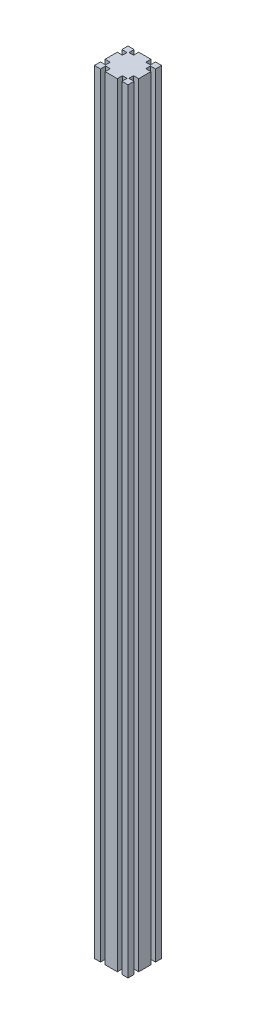
ISO-10303-21;
HEADER;
FILE_DESCRIPTION(('STEP AP214'),'2;1');
FILE_NAME('part.step','',(''),(''),'','','');
FILE_SCHEMA(('AUTOMOTIVE_DESIGN { 1 0 10303 214 1 1 1 1 }'));
ENDSEC;
DATA;
#1=APPLICATION_CONTEXT('core data for automotive mechanical design processes');
#2=APPLICATION_PROTOCOL_DEFINITION('international standard','automotive_design',2000,#1);
#3=PRODUCT_CONTEXT('',#1,'mechanical');
#4=PRODUCT('Part','Part','',(#3));
#5=PRODUCT_RELATED_PRODUCT_CATEGORY('part','',(#4));
#6=PRODUCT_DEFINITION_FORMATION('','',#4);
#7=PRODUCT_DEFINITION_CONTEXT('part definition',#1,'design');
#8=PRODUCT_DEFINITION('design','',#6,#7);
#9=PRODUCT_DEFINITION_SHAPE('','',#8);
#10=(LENGTH_UNIT() NAMED_UNIT(*) SI_UNIT(.MILLI.,.METRE.));
#11=(NAMED_UNIT(*) PLANE_ANGLE_UNIT() SI_UNIT($,.RADIAN.));
#12=(NAMED_UNIT(*) SI_UNIT($,.STERADIAN.) SOLID_ANGLE_UNIT());
#13=UNCERTAINTY_MEASURE_WITH_UNIT(LENGTH_MEASURE(1.E-05),#10,'distance_accuracy_value','');
#14=(GEOMETRIC_REPRESENTATION_CONTEXT(3) GLOBAL_UNCERTAINTY_ASSIGNED_CONTEXT((#13)) GLOBAL_UNIT_ASSIGNED_CONTEXT((#10,
#11,#12)) REPRESENTATION_CONTEXT('',''));
#15=CARTESIAN_POINT('',(0.,0.,0.));
#16=DIRECTION('',(0.,0.,1.));
#17=DIRECTION('',(1.,0.,0.));
#18=AXIS2_PLACEMENT_3D('',#15,#16,#17);
#19=CARTESIAN_POINT('',(19.1,1380.,0.));
#20=DIRECTION('',(-1.,0.,0.));
#21=DIRECTION('',(0.,0.,1.));
#22=AXIS2_PLACEMENT_3D('',#19,#20,#21);
#23=PLANE('',#22);
#24=DIRECTION('',(0.,0.,-1.));
#25=VECTOR('',#24,1.);
#26=CARTESIAN_POINT('',(19.1,0.,0.));
#27=LINE('',#26,#25);
#28=CARTESIAN_POINT('',(19.1,0.,-50.8));
#29=VERTEX_POINT('',#28);
#30=CARTESIAN_POINT('',(19.1,0.,-60.));
#31=VERTEX_POINT('',#30);
#32=EDGE_CURVE('E309',#29,#31,#27,.T.);
#33=ORIENTED_EDGE('',*,*,#32,.F.);
#34=DIRECTION('',(0.,-1.,0.));
#35=VECTOR('',#34,1.);
#36=CARTESIAN_POINT('',(19.1,1380.,-50.8));
#37=LINE('',#36,#35);
#38=CARTESIAN_POINT('',(19.1,1380.,-50.8));
#39=VERTEX_POINT('',#38);
#40=EDGE_CURVE('E11',#39,#29,#37,.T.);
#41=ORIENTED_EDGE('',*,*,#40,.F.);
#42=DIRECTION('',(0.,0.,-1.));
#43=VECTOR('',#42,1.);
#44=CARTESIAN_POINT('',(19.1,1380.,0.));
#45=LINE('',#44,#43);
#46=CARTESIAN_POINT('',(19.1,1380.,-60.));
#47=VERTEX_POINT('',#46);
#48=EDGE_CURVE('E557',#39,#47,#45,.T.);
#49=ORIENTED_EDGE('',*,*,#48,.T.);
#50=DIRECTION('',(0.,-1.,0.));
#51=VECTOR('',#50,1.);
#52=CARTESIAN_POINT('',(19.1,1380.,-60.));
#53=LINE('',#52,#51);
#54=EDGE_CURVE('E58',#47,#31,#53,.T.);
#55=ORIENTED_EDGE('',*,*,#54,.T.);
#56=EDGE_LOOP('',(#33,#41,#49,#55));
#57=FACE_BOUND('',#56,.T.);
#58=ADVANCED_FACE('F41',(#57),#23,.T.);
#59=CARTESIAN_POINT('',(0.,1380.,-50.8));
#60=DIRECTION('',(0.,0.,-1.));
#61=DIRECTION('',(-1.,0.,0.));
#62=AXIS2_PLACEMENT_3D('',#59,#60,#61);
#63=PLANE('',#62);
#64=DIRECTION('',(1.,0.,0.));
#65=VECTOR('',#64,1.);
#66=CARTESIAN_POINT('',(0.,0.,-50.8));
#67=LINE('',#66,#65);
#68=CARTESIAN_POINT('',(10.9,0.,-50.8));
#69=VERTEX_POINT('',#68);
#70=EDGE_CURVE('E312',#69,#29,#67,.T.);
#71=ORIENTED_EDGE('',*,*,#70,.F.);
#72=DIRECTION('',(0.,-1.,0.));
#73=VECTOR('',#72,1.);
#74=CARTESIAN_POINT('',(10.9,1380.,-50.8));
#75=LINE('',#74,#73);
#76=CARTESIAN_POINT('',(10.9,1380.,-50.8));
#77=VERTEX_POINT('',#76);
#78=EDGE_CURVE('E50',#77,#69,#75,.T.);
#79=ORIENTED_EDGE('',*,*,#78,.F.);
#80=DIRECTION('',(1.,0.,0.));
#81=VECTOR('',#80,1.);
#82=CARTESIAN_POINT('',(0.,1380.,-50.8));
#83=LINE('',#82,#81);
#84=EDGE_CURVE('E551',#77,#39,#83,.T.);
#85=ORIENTED_EDGE('',*,*,#84,.T.);
#86=ORIENTED_EDGE('',*,*,#40,.T.);
#87=EDGE_LOOP('',(#71,#79,#85,#86));
#88=FACE_BOUND('',#87,.T.);
#89=ADVANCED_FACE('F540',(#88),#63,.T.);
#90=CARTESIAN_POINT('',(10.9,1380.,0.));
#91=DIRECTION('',(1.,0.,0.));
#92=DIRECTION('',(0.,0.,-1.));
#93=AXIS2_PLACEMENT_3D('',#90,#91,#92);
#94=PLANE('',#93);
#95=DIRECTION('',(0.,0.,1.));
#96=VECTOR('',#95,1.);
#97=CARTESIAN_POINT('',(10.9,0.,0.));
#98=LINE('',#97,#96);
#99=CARTESIAN_POINT('',(10.9,0.,-60.));
#100=VERTEX_POINT('',#99);
#101=EDGE_CURVE('E316',#100,#69,#98,.T.);
#102=ORIENTED_EDGE('',*,*,#101,.F.);
#103=DIRECTION('',(0.,-1.,0.));
#104=VECTOR('',#103,1.);
#105=CARTESIAN_POINT('',(10.9,1380.,-60.));
#106=LINE('',#105,#104);
#107=CARTESIAN_POINT('',(10.9,1380.,-60.));
#108=VERTEX_POINT('',#107);
#109=EDGE_CURVE('E527',#108,#100,#106,.T.);
#110=ORIENTED_EDGE('',*,*,#109,.F.);
#111=DIRECTION('',(0.,0.,1.));
#112=VECTOR('',#111,1.);
#113=CARTESIAN_POINT('',(10.9,1380.,0.));
#114=LINE('',#113,#112);
#115=EDGE_CURVE('E536',#108,#77,#114,.T.);
#116=ORIENTED_EDGE('',*,*,#115,.T.);
#117=ORIENTED_EDGE('',*,*,#78,.T.);
#118=EDGE_LOOP('',(#102,#110,#116,#117));
#119=FACE_BOUND('',#118,.T.);
#120=ADVANCED_FACE('F534',(#119),#94,.T.);
#121=CARTESIAN_POINT('',(0.,1380.,-60.));
#122=DIRECTION('',(0.,0.,-1.));
#123=DIRECTION('',(-1.,0.,0.));
#124=AXIS2_PLACEMENT_3D('',#121,#122,#123);
#125=PLANE('',#124);
#126=DIRECTION('',(1.,0.,0.));
#127=VECTOR('',#126,1.);
#128=CARTESIAN_POINT('',(0.,0.,-60.));
#129=LINE('',#128,#127);
#130=CARTESIAN_POINT('',(0.,0.,-60.));
#131=VERTEX_POINT('',#130);
#132=EDGE_CURVE('E320',#131,#100,#129,.T.);
#133=ORIENTED_EDGE('',*,*,#132,.F.);
#134=DIRECTION('',(0.,-1.,0.));
#135=VECTOR('',#134,1.);
#136=CARTESIAN_POINT('',(0.,1380.,-60.));
#137=LINE('',#136,#135);
#138=CARTESIAN_POINT('',(0.,1380.,-60.));
#139=VERTEX_POINT('',#138);
#140=EDGE_CURVE('E524',#139,#131,#137,.T.);
#141=ORIENTED_EDGE('',*,*,#140,.F.);
#142=DIRECTION('',(1.,0.,0.));
#143=VECTOR('',#142,1.);
#144=CARTESIAN_POINT('',(0.,1380.,-60.));
#145=LINE('',#144,#143);
#146=EDGE_CURVE('E306',#139,#108,#145,.T.);
#147=ORIENTED_EDGE('',*,*,#146,.T.);
#148=ORIENTED_EDGE('',*,*,#109,.T.);
#149=EDGE_LOOP('',(#133,#141,#147,#148));
#150=FACE_BOUND('',#149,.T.);
#151=ADVANCED_FACE('F547',(#150),#125,.T.);
#152=CARTESIAN_POINT('',(0.,1380.,0.));
#153=DIRECTION('',(1.,0.,0.));
#154=DIRECTION('',(0.,0.,-1.));
#155=AXIS2_PLACEMENT_3D('',#152,#153,#154);
#156=PLANE('',#155);
#157=DIRECTION('',(0.,0.,1.));
#158=VECTOR('',#157,1.);
#159=CARTESIAN_POINT('',(0.,0.,0.));
#160=LINE('',#159,#158);
#161=CARTESIAN_POINT('',(0.,0.,-49.1));
#162=VERTEX_POINT('',#161);
#163=EDGE_CURVE('E324',#131,#162,#160,.T.);
#164=ORIENTED_EDGE('',*,*,#163,.T.);
#165=DIRECTION('',(0.,-1.,0.));
#166=VECTOR('',#165,1.);
#167=CARTESIAN_POINT('',(0.,1380.,-49.1));
#168=LINE('',#167,#166);
#169=CARTESIAN_POINT('',(0.,1380.,-49.1));
#170=VERTEX_POINT('',#169);
#171=EDGE_CURVE('E520',#170,#162,#168,.T.);
#172=ORIENTED_EDGE('',*,*,#171,.F.);
#173=DIRECTION('',(0.,0.,1.));
#174=VECTOR('',#173,1.);
#175=CARTESIAN_POINT('',(0.,1380.,0.));
#176=LINE('',#175,#174);
#177=EDGE_CURVE('E556',#139,#170,#176,.T.);
#178=ORIENTED_EDGE('',*,*,#177,.F.);
#179=ORIENTED_EDGE('',*,*,#140,.T.);
#180=EDGE_LOOP('',(#164,#172,#178,#179));
#181=FACE_BOUND('',#180,.T.);
#182=ADVANCED_FACE('F741',(#181),#156,.F.);
#183=CARTESIAN_POINT('',(0.,1380.,-49.1));
#184=DIRECTION('',(0.,0.,-1.));
#185=DIRECTION('',(-1.,0.,0.));
#186=AXIS2_PLACEMENT_3D('',#183,#184,#185);
#187=PLANE('',#186);
#188=DIRECTION('',(1.,0.,0.));
#189=VECTOR('',#188,1.);
#190=CARTESIAN_POINT('',(0.,0.,-49.1));
#191=LINE('',#190,#189);
#192=CARTESIAN_POINT('',(9.2,0.,-49.1));
#193=VERTEX_POINT('',#192);
#194=EDGE_CURVE('E328',#162,#193,#191,.T.);
#195=ORIENTED_EDGE('',*,*,#194,.T.);
#196=DIRECTION('',(0.,-1.,0.));
#197=VECTOR('',#196,1.);
#198=CARTESIAN_POINT('',(9.2,1380.,-49.1));
#199=LINE('',#198,#197);
#200=CARTESIAN_POINT('',(9.2,1380.,-49.1));
#201=VERTEX_POINT('',#200);
#202=EDGE_CURVE('E516',#201,#193,#199,.T.);
#203=ORIENTED_EDGE('',*,*,#202,.F.);
#204=DIRECTION('',(1.,0.,0.));
#205=VECTOR('',#204,1.);
#206=CARTESIAN_POINT('',(0.,1380.,-49.1));
#207=LINE('',#206,#205);
#208=EDGE_CURVE('E563',#170,#201,#207,.T.);
#209=ORIENTED_EDGE('',*,*,#208,.F.);
#210=ORIENTED_EDGE('',*,*,#171,.T.);
#211=EDGE_LOOP('',(#195,#203,#209,#210));
#212=FACE_BOUND('',#211,.T.);
#213=ADVANCED_FACE('F753',(#212),#187,.F.);
#214=CARTESIAN_POINT('',(9.20000000000001,1380.,0.));
#215=DIRECTION('',(1.,0.,0.));
#216=DIRECTION('',(0.,0.,-1.));
#217=AXIS2_PLACEMENT_3D('',#214,#215,#216);
#218=PLANE('',#217);
#219=DIRECTION('',(0.,0.,1.));
#220=VECTOR('',#219,1.);
#221=CARTESIAN_POINT('',(9.20000000000001,0.,0.));
#222=LINE('',#221,#220);
#223=CARTESIAN_POINT('',(9.2,0.,-40.9));
#224=VERTEX_POINT('',#223);
#225=EDGE_CURVE('E331',#193,#224,#222,.T.);
#226=ORIENTED_EDGE('',*,*,#225,.T.);
#227=DIRECTION('',(0.,-1.,0.));
#228=VECTOR('',#227,1.);
#229=CARTESIAN_POINT('',(9.2,1380.,-40.9));
#230=LINE('',#229,#228);
#231=CARTESIAN_POINT('',(9.2,1380.,-40.9));
#232=VERTEX_POINT('',#231);
#233=EDGE_CURVE('E512',#232,#224,#230,.T.);
#234=ORIENTED_EDGE('',*,*,#233,.F.);
#235=DIRECTION('',(0.,0.,1.));
#236=VECTOR('',#235,1.);
#237=CARTESIAN_POINT('',(9.20000000000001,1380.,0.));
#238=LINE('',#237,#236);
#239=EDGE_CURVE('E566',#201,#232,#238,.T.);
#240=ORIENTED_EDGE('',*,*,#239,.F.);
#241=ORIENTED_EDGE('',*,*,#202,.T.);
#242=EDGE_LOOP('',(#226,#234,#240,#241));
#243=FACE_BOUND('',#242,.T.);
#244=ADVANCED_FACE('F757',(#243),#218,.F.);
#245=CARTESIAN_POINT('',(0.,1380.,-40.9));
#246=DIRECTION('',(0.,0.,1.));
#247=DIRECTION('',(1.,0.,0.));
#248=AXIS2_PLACEMENT_3D('',#245,#246,#247);
#249=PLANE('',#248);
#250=DIRECTION('',(-1.,0.,0.));
#251=VECTOR('',#250,1.);
#252=CARTESIAN_POINT('',(0.,0.,-40.9));
#253=LINE('',#252,#251);
#254=CARTESIAN_POINT('',(0.,0.,-40.9));
#255=VERTEX_POINT('',#254);
#256=EDGE_CURVE('E334',#224,#255,#253,.T.);
#257=ORIENTED_EDGE('',*,*,#256,.T.);
#258=DIRECTION('',(0.,-1.,0.));
#259=VECTOR('',#258,1.);
#260=CARTESIAN_POINT('',(0.,1380.,-40.9));
#261=LINE('',#260,#259);
#262=CARTESIAN_POINT('',(0.,1380.,-40.9));
#263=VERTEX_POINT('',#262);
#264=EDGE_CURVE('E509',#263,#255,#261,.T.);
#265=ORIENTED_EDGE('',*,*,#264,.F.);
#266=DIRECTION('',(-1.,0.,0.));
#267=VECTOR('',#266,1.);
#268=CARTESIAN_POINT('',(0.,1380.,-40.9));
#269=LINE('',#268,#267);
#270=EDGE_CURVE('E569',#232,#263,#269,.T.);
#271=ORIENTED_EDGE('',*,*,#270,.F.);
#272=ORIENTED_EDGE('',*,*,#233,.T.);
#273=EDGE_LOOP('',(#257,#265,#271,#272));
#274=FACE_BOUND('',#273,.T.);
#275=ADVANCED_FACE('F761',(#274),#249,.F.);
#276=CARTESIAN_POINT('',(0.,1380.,0.));
#277=DIRECTION('',(-1.,0.,0.));
#278=DIRECTION('',(0.,0.,1.));
#279=AXIS2_PLACEMENT_3D('',#276,#277,#278);
#280=PLANE('',#279);
#281=DIRECTION('',(0.,0.,-1.));
#282=VECTOR('',#281,1.);
#283=CARTESIAN_POINT('',(0.,0.,0.));
#284=LINE('',#283,#282);
#285=CARTESIAN_POINT('',(0.,0.,-19.1));
#286=VERTEX_POINT('',#285);
#287=EDGE_CURVE('E338',#286,#255,#284,.T.);
#288=ORIENTED_EDGE('',*,*,#287,.F.);
#289=DIRECTION('',(0.,-1.,0.));
#290=VECTOR('',#289,1.);
#291=CARTESIAN_POINT('',(0.,1380.,-19.1));
#292=LINE('',#291,#290);
#293=CARTESIAN_POINT('',(0.,1380.,-19.1));
#294=VERTEX_POINT('',#293);
#295=EDGE_CURVE('E506',#294,#286,#292,.T.);
#296=ORIENTED_EDGE('',*,*,#295,.F.);
#297=DIRECTION('',(0.,0.,-1.));
#298=VECTOR('',#297,1.);
#299=CARTESIAN_POINT('',(0.,1380.,0.));
#300=LINE('',#299,#298);
#301=EDGE_CURVE('E572',#294,#263,#300,.T.);
#302=ORIENTED_EDGE('',*,*,#301,.T.);
#303=ORIENTED_EDGE('',*,*,#264,.T.);
#304=EDGE_LOOP('',(#288,#296,#302,#303));
#305=FACE_BOUND('',#304,.T.);
#306=ADVANCED_FACE('F765',(#305),#280,.T.);
#307=CARTESIAN_POINT('',(0.,1380.,-19.1));
#308=DIRECTION('',(0.,0.,1.));
#309=DIRECTION('',(1.,0.,0.));
#310=AXIS2_PLACEMENT_3D('',#307,#308,#309);
#311=PLANE('',#310);
#312=DIRECTION('',(-1.,0.,0.));
#313=VECTOR('',#312,1.);
#314=CARTESIAN_POINT('',(0.,0.,-19.1));
#315=LINE('',#314,#313);
#316=CARTESIAN_POINT('',(9.20000000000002,0.,-19.1));
#317=VERTEX_POINT('',#316);
#318=EDGE_CURVE('E342',#317,#286,#315,.T.);
#319=ORIENTED_EDGE('',*,*,#318,.F.);
#320=DIRECTION('',(0.,-1.,0.));
#321=VECTOR('',#320,1.);
#322=CARTESIAN_POINT('',(9.20000000000002,1380.,-19.1));
#323=LINE('',#322,#321);
#324=CARTESIAN_POINT('',(9.20000000000002,1380.,-19.1));
#325=VERTEX_POINT('',#324);
#326=EDGE_CURVE('E503',#325,#317,#323,.T.);
#327=ORIENTED_EDGE('',*,*,#326,.F.);
#328=DIRECTION('',(-1.,0.,0.));
#329=VECTOR('',#328,1.);
#330=CARTESIAN_POINT('',(0.,1380.,-19.1));
#331=LINE('',#330,#329);
#332=EDGE_CURVE('E576',#325,#294,#331,.T.);
#333=ORIENTED_EDGE('',*,*,#332,.T.);
#334=ORIENTED_EDGE('',*,*,#295,.T.);
#335=EDGE_LOOP('',(#319,#327,#333,#334));
#336=FACE_BOUND('',#335,.T.);
#337=ADVANCED_FACE('F769',(#336),#311,.T.);
#338=CARTESIAN_POINT('',(9.2,1380.,0.));
#339=DIRECTION('',(-1.,0.,0.));
#340=DIRECTION('',(0.,0.,1.));
#341=AXIS2_PLACEMENT_3D('',#338,#339,#340);
#342=PLANE('',#341);
#343=DIRECTION('',(0.,0.,-1.));
#344=VECTOR('',#343,1.);
#345=CARTESIAN_POINT('',(9.2,0.,0.));
#346=LINE('',#345,#344);
#347=CARTESIAN_POINT('',(9.20000000000001,0.,-10.9));
#348=VERTEX_POINT('',#347);
#349=EDGE_CURVE('E346',#348,#317,#346,.T.);
#350=ORIENTED_EDGE('',*,*,#349,.F.);
#351=DIRECTION('',(0.,-1.,0.));
#352=VECTOR('',#351,1.);
#353=CARTESIAN_POINT('',(9.20000000000001,1380.,-10.9));
#354=LINE('',#353,#352);
#355=CARTESIAN_POINT('',(9.20000000000001,1380.,-10.9));
#356=VERTEX_POINT('',#355);
#357=EDGE_CURVE('E500',#356,#348,#354,.T.);
#358=ORIENTED_EDGE('',*,*,#357,.F.);
#359=DIRECTION('',(0.,0.,-1.));
#360=VECTOR('',#359,1.);
#361=CARTESIAN_POINT('',(9.2,1380.,0.));
#362=LINE('',#361,#360);
#363=EDGE_CURVE('E580',#356,#325,#362,.T.);
#364=ORIENTED_EDGE('',*,*,#363,.T.);
#365=ORIENTED_EDGE('',*,*,#326,.T.);
#366=EDGE_LOOP('',(#350,#358,#364,#365));
#367=FACE_BOUND('',#366,.T.);
#368=ADVANCED_FACE('F773',(#367),#342,.T.);
#369=CARTESIAN_POINT('',(0.,1380.,-10.9));
#370=DIRECTION('',(0.,0.,-1.));
#371=DIRECTION('',(-1.,0.,0.));
#372=AXIS2_PLACEMENT_3D('',#369,#370,#371);
#373=PLANE('',#372);
#374=DIRECTION('',(1.,0.,0.));
#375=VECTOR('',#374,1.);
#376=CARTESIAN_POINT('',(0.,0.,-10.9));
#377=LINE('',#376,#375);
#378=CARTESIAN_POINT('',(0.,0.,-10.9));
#379=VERTEX_POINT('',#378);
#380=EDGE_CURVE('E350',#379,#348,#377,.T.);
#381=ORIENTED_EDGE('',*,*,#380,.F.);
#382=DIRECTION('',(0.,-1.,0.));
#383=VECTOR('',#382,1.);
#384=CARTESIAN_POINT('',(0.,1380.,-10.9));
#385=LINE('',#384,#383);
#386=CARTESIAN_POINT('',(0.,1380.,-10.9));
#387=VERTEX_POINT('',#386);
#388=EDGE_CURVE('E497',#387,#379,#385,.T.);
#389=ORIENTED_EDGE('',*,*,#388,.F.);
#390=DIRECTION('',(1.,0.,0.));
#391=VECTOR('',#390,1.);
#392=CARTESIAN_POINT('',(0.,1380.,-10.9));
#393=LINE('',#392,#391);
#394=EDGE_CURVE('E584',#387,#356,#393,.T.);
#395=ORIENTED_EDGE('',*,*,#394,.T.);
#396=ORIENTED_EDGE('',*,*,#357,.T.);
#397=EDGE_LOOP('',(#381,#389,#395,#396));
#398=FACE_BOUND('',#397,.T.);
#399=ADVANCED_FACE('F777',(#398),#373,.T.);
#400=CARTESIAN_POINT('',(0.,1380.,0.));
#401=DIRECTION('',(-1.,0.,0.));
#402=DIRECTION('',(0.,0.,1.));
#403=AXIS2_PLACEMENT_3D('',#400,#401,#402);
#404=PLANE('',#403);
#405=DIRECTION('',(0.,0.,-1.));
#406=VECTOR('',#405,1.);
#407=CARTESIAN_POINT('',(0.,0.,0.));
#408=LINE('',#407,#406);
#409=CARTESIAN_POINT('',(0.,0.,0.));
#410=VERTEX_POINT('',#409);
#411=EDGE_CURVE('E354',#410,#379,#408,.T.);
#412=ORIENTED_EDGE('',*,*,#411,.F.);
#413=DIRECTION('',(0.,-1.,0.));
#414=VECTOR('',#413,1.);
#415=CARTESIAN_POINT('',(0.,1380.,0.));
#416=LINE('',#415,#414);
#417=CARTESIAN_POINT('',(0.,1380.,0.));
#418=VERTEX_POINT('',#417);
#419=EDGE_CURVE('E494',#418,#410,#416,.T.);
#420=ORIENTED_EDGE('',*,*,#419,.F.);
#421=DIRECTION('',(0.,0.,-1.));
#422=VECTOR('',#421,1.);
#423=CARTESIAN_POINT('',(0.,1380.,0.));
#424=LINE('',#423,#422);
#425=EDGE_CURVE('E588',#418,#387,#424,.T.);
#426=ORIENTED_EDGE('',*,*,#425,.T.);
#427=ORIENTED_EDGE('',*,*,#388,.T.);
#428=EDGE_LOOP('',(#412,#420,#426,#427));
#429=FACE_BOUND('',#428,.T.);
#430=ADVANCED_FACE('F781',(#429),#404,.T.);
#431=CARTESIAN_POINT('',(0.,1380.,0.));
#432=DIRECTION('',(0.,0.,-1.));
#433=DIRECTION('',(-1.,0.,0.));
#434=AXIS2_PLACEMENT_3D('',#431,#432,#433);
#435=PLANE('',#434);
#436=DIRECTION('',(1.,0.,0.));
#437=VECTOR('',#436,1.);
#438=CARTESIAN_POINT('',(0.,0.,0.));
#439=LINE('',#438,#437);
#440=CARTESIAN_POINT('',(10.9,0.,0.));
#441=VERTEX_POINT('',#440);
#442=EDGE_CURVE('E358',#410,#441,#439,.T.);
#443=ORIENTED_EDGE('',*,*,#442,.T.);
#444=DIRECTION('',(0.,-1.,0.));
#445=VECTOR('',#444,1.);
#446=CARTESIAN_POINT('',(10.9,1380.,0.));
#447=LINE('',#446,#445);
#448=CARTESIAN_POINT('',(10.9,1380.,0.));
#449=VERTEX_POINT('',#448);
#450=EDGE_CURVE('E490',#449,#441,#447,.T.);
#451=ORIENTED_EDGE('',*,*,#450,.F.);
#452=DIRECTION('',(1.,0.,0.));
#453=VECTOR('',#452,1.);
#454=CARTESIAN_POINT('',(0.,1380.,0.));
#455=LINE('',#454,#453);
#456=EDGE_CURVE('E592',#418,#449,#455,.T.);
#457=ORIENTED_EDGE('',*,*,#456,.F.);
#458=ORIENTED_EDGE('',*,*,#419,.T.);
#459=EDGE_LOOP('',(#443,#451,#457,#458));
#460=FACE_BOUND('',#459,.T.);
#461=ADVANCED_FACE('F785',(#460),#435,.F.);
#462=CARTESIAN_POINT('',(10.9,1380.,0.));
#463=DIRECTION('',(-1.,0.,0.));
#464=DIRECTION('',(0.,0.,1.));
#465=AXIS2_PLACEMENT_3D('',#462,#463,#464);
#466=PLANE('',#465);
#467=DIRECTION('',(0.,0.,-1.));
#468=VECTOR('',#467,1.);
#469=CARTESIAN_POINT('',(10.9,0.,0.));
#470=LINE('',#469,#468);
#471=CARTESIAN_POINT('',(10.9,0.,-9.20000000000001));
#472=VERTEX_POINT('',#471);
#473=EDGE_CURVE('E361',#441,#472,#470,.T.);
#474=ORIENTED_EDGE('',*,*,#473,.T.);
#475=DIRECTION('',(0.,-1.,0.));
#476=VECTOR('',#475,1.);
#477=CARTESIAN_POINT('',(10.9,1380.,-9.20000000000001));
#478=LINE('',#477,#476);
#479=CARTESIAN_POINT('',(10.9,1380.,-9.20000000000001));
#480=VERTEX_POINT('',#479);
#481=EDGE_CURVE('E486',#480,#472,#478,.T.);
#482=ORIENTED_EDGE('',*,*,#481,.F.);
#483=DIRECTION('',(0.,0.,-1.));
#484=VECTOR('',#483,1.);
#485=CARTESIAN_POINT('',(10.9,1380.,0.));
#486=LINE('',#485,#484);
#487=EDGE_CURVE('E595',#449,#480,#486,.T.);
#488=ORIENTED_EDGE('',*,*,#487,.F.);
#489=ORIENTED_EDGE('',*,*,#450,.T.);
#490=EDGE_LOOP('',(#474,#482,#488,#489));
#491=FACE_BOUND('',#490,.T.);
#492=ADVANCED_FACE('F787',(#491),#466,.F.);
#493=CARTESIAN_POINT('',(0.,1380.,-9.19999999999999));
#494=DIRECTION('',(0.,0.,-1.));
#495=DIRECTION('',(-1.,0.,0.));
#496=AXIS2_PLACEMENT_3D('',#493,#494,#495);
#497=PLANE('',#496);
#498=DIRECTION('',(1.,0.,0.));
#499=VECTOR('',#498,1.);
#500=CARTESIAN_POINT('',(0.,0.,-9.19999999999999));
#501=LINE('',#500,#499);
#502=CARTESIAN_POINT('',(19.1,0.,-9.20000000000003));
#503=VERTEX_POINT('',#502);
#504=EDGE_CURVE('E366',#472,#503,#501,.T.);
#505=ORIENTED_EDGE('',*,*,#504,.T.);
#506=DIRECTION('',(0.,-1.,0.));
#507=VECTOR('',#506,1.);
#508=CARTESIAN_POINT('',(19.1,1380.,-9.20000000000003));
#509=LINE('',#508,#507);
#510=CARTESIAN_POINT('',(19.1,1380.,-9.20000000000003));
#511=VERTEX_POINT('',#510);
#512=EDGE_CURVE('E482',#511,#503,#509,.T.);
#513=ORIENTED_EDGE('',*,*,#512,.F.);
#514=DIRECTION('',(1.,0.,0.));
#515=VECTOR('',#514,1.);
#516=CARTESIAN_POINT('',(0.,1380.,-9.19999999999999));
#517=LINE('',#516,#515);
#518=EDGE_CURVE('E600',#480,#511,#517,.T.);
#519=ORIENTED_EDGE('',*,*,#518,.F.);
#520=ORIENTED_EDGE('',*,*,#481,.T.);
#521=EDGE_LOOP('',(#505,#513,#519,#520));
#522=FACE_BOUND('',#521,.T.);
#523=ADVANCED_FACE('F790',(#522),#497,.F.);
#524=CARTESIAN_POINT('',(19.1,1380.,0.));
#525=DIRECTION('',(1.,0.,0.));
#526=DIRECTION('',(0.,0.,-1.));
#527=AXIS2_PLACEMENT_3D('',#524,#525,#526);
#528=PLANE('',#527);
#529=DIRECTION('',(0.,0.,1.));
#530=VECTOR('',#529,1.);
#531=CARTESIAN_POINT('',(19.1,0.,0.));
#532=LINE('',#531,#530);
#533=CARTESIAN_POINT('',(19.1,0.,0.));
#534=VERTEX_POINT('',#533);
#535=EDGE_CURVE('E369',#503,#534,#532,.T.);
#536=ORIENTED_EDGE('',*,*,#535,.T.);
#537=DIRECTION('',(0.,-1.,0.));
#538=VECTOR('',#537,1.);
#539=CARTESIAN_POINT('',(19.1,1380.,0.));
#540=LINE('',#539,#538);
#541=CARTESIAN_POINT('',(19.1,1380.,0.));
#542=VERTEX_POINT('',#541);
#543=EDGE_CURVE('E478',#542,#534,#540,.T.);
#544=ORIENTED_EDGE('',*,*,#543,.F.);
#545=DIRECTION('',(0.,0.,1.));
#546=VECTOR('',#545,1.);
#547=CARTESIAN_POINT('',(19.1,1380.,0.));
#548=LINE('',#547,#546);
#549=EDGE_CURVE('E603',#511,#542,#548,.T.);
#550=ORIENTED_EDGE('',*,*,#549,.F.);
#551=ORIENTED_EDGE('',*,*,#512,.T.);
#552=EDGE_LOOP('',(#536,#544,#550,#551));
#553=FACE_BOUND('',#552,.T.);
#554=ADVANCED_FACE('F794',(#553),#528,.F.);
#555=CARTESIAN_POINT('',(40.9,0.,0.));
#556=VERTEX_POINT('',#555);
#557=EDGE_CURVE('E363',#534,#556,#439,.T.);
#558=ORIENTED_EDGE('',*,*,#557,.T.);
#559=DIRECTION('',(0.,-1.,0.));
#560=VECTOR('',#559,1.);
#561=CARTESIAN_POINT('',(40.9,1380.,0.));
#562=LINE('',#561,#560);
#563=CARTESIAN_POINT('',(40.9,1380.,0.));
#564=VERTEX_POINT('',#563);
#565=EDGE_CURVE('E475',#564,#556,#562,.T.);
#566=ORIENTED_EDGE('',*,*,#565,.F.);
#567=EDGE_CURVE('E597',#542,#564,#455,.T.);
#568=ORIENTED_EDGE('',*,*,#567,.F.);
#569=ORIENTED_EDGE('',*,*,#543,.T.);
#570=EDGE_LOOP('',(#558,#566,#568,#569));
#571=FACE_BOUND('',#570,.T.);
#572=ADVANCED_FACE('F660',(#571),#435,.F.);
#573=CARTESIAN_POINT('',(40.9,1380.,0.));
#574=DIRECTION('',(1.,0.,0.));
#575=DIRECTION('',(0.,0.,-1.));
#576=AXIS2_PLACEMENT_3D('',#573,#574,#575);
#577=PLANE('',#576);
#578=DIRECTION('',(0.,0.,1.));
#579=VECTOR('',#578,1.);
#580=CARTESIAN_POINT('',(40.9,0.,0.));
#581=LINE('',#580,#579);
#582=CARTESIAN_POINT('',(40.9,0.,-9.19999999999999));
#583=VERTEX_POINT('',#582);
#584=EDGE_CURVE('E372',#583,#556,#581,.T.);
#585=ORIENTED_EDGE('',*,*,#584,.F.);
#586=DIRECTION('',(0.,-1.,0.));
#587=VECTOR('',#586,1.);
#588=CARTESIAN_POINT('',(40.9,1380.,-9.19999999999999));
#589=LINE('',#588,#587);
#590=CARTESIAN_POINT('',(40.9,1380.,-9.19999999999999));
#591=VERTEX_POINT('',#590);
#592=EDGE_CURVE('E472',#591,#583,#589,.T.);
#593=ORIENTED_EDGE('',*,*,#592,.F.);
#594=DIRECTION('',(0.,0.,1.));
#595=VECTOR('',#594,1.);
#596=CARTESIAN_POINT('',(40.9,1380.,0.));
#597=LINE('',#596,#595);
#598=EDGE_CURVE('E606',#591,#564,#597,.T.);
#599=ORIENTED_EDGE('',*,*,#598,.T.);
#600=ORIENTED_EDGE('',*,*,#565,.T.);
#601=EDGE_LOOP('',(#585,#593,#599,#600));
#602=FACE_BOUND('',#601,.T.);
#603=ADVANCED_FACE('F664',(#602),#577,.T.);
#604=CARTESIAN_POINT('',(0.,1380.,-9.19999999999999));
#605=DIRECTION('',(0.,0.,1.));
#606=DIRECTION('',(1.,0.,0.));
#607=AXIS2_PLACEMENT_3D('',#604,#605,#606);
#608=PLANE('',#607);
#609=DIRECTION('',(-1.,0.,0.));
#610=VECTOR('',#609,1.);
#611=CARTESIAN_POINT('',(0.,0.,-9.19999999999999));
#612=LINE('',#611,#610);
#613=CARTESIAN_POINT('',(49.1,0.,-9.19999999999999));
#614=VERTEX_POINT('',#613);
#615=EDGE_CURVE('E376',#614,#583,#612,.T.);
#616=ORIENTED_EDGE('',*,*,#615,.F.);
#617=DIRECTION('',(0.,-1.,0.));
#618=VECTOR('',#617,1.);
#619=CARTESIAN_POINT('',(49.1,1380.,-9.19999999999999));
#620=LINE('',#619,#618);
#621=CARTESIAN_POINT('',(49.1,1380.,-9.19999999999999));
#622=VERTEX_POINT('',#621);
#623=EDGE_CURVE('E469',#622,#614,#620,.T.);
#624=ORIENTED_EDGE('',*,*,#623,.F.);
#625=DIRECTION('',(-1.,0.,0.));
#626=VECTOR('',#625,1.);
#627=CARTESIAN_POINT('',(0.,1380.,-9.19999999999999));
#628=LINE('',#627,#626);
#629=EDGE_CURVE('E610',#622,#591,#628,.T.);
#630=ORIENTED_EDGE('',*,*,#629,.T.);
#631=ORIENTED_EDGE('',*,*,#592,.T.);
#632=EDGE_LOOP('',(#616,#624,#630,#631));
#633=FACE_BOUND('',#632,.T.);
#634=ADVANCED_FACE('F667',(#633),#608,.T.);
#635=CARTESIAN_POINT('',(49.1,1380.,0.));
#636=DIRECTION('',(-1.,0.,0.));
#637=DIRECTION('',(0.,0.,1.));
#638=AXIS2_PLACEMENT_3D('',#635,#636,#637);
#639=PLANE('',#638);
#640=DIRECTION('',(0.,0.,-1.));
#641=VECTOR('',#640,1.);
#642=CARTESIAN_POINT('',(49.1,0.,0.));
#643=LINE('',#642,#641);
#644=CARTESIAN_POINT('',(49.1,0.,0.));
#645=VERTEX_POINT('',#644);
#646=EDGE_CURVE('E380',#645,#614,#643,.T.);
#647=ORIENTED_EDGE('',*,*,#646,.F.);
#648=DIRECTION('',(0.,-1.,0.));
#649=VECTOR('',#648,1.);
#650=CARTESIAN_POINT('',(49.1,1380.,0.));
#651=LINE('',#650,#649);
#652=CARTESIAN_POINT('',(49.1,1380.,0.));
#653=VERTEX_POINT('',#652);
#654=EDGE_CURVE('E466',#653,#645,#651,.T.);
#655=ORIENTED_EDGE('',*,*,#654,.F.);
#656=DIRECTION('',(0.,0.,-1.));
#657=VECTOR('',#656,1.);
#658=CARTESIAN_POINT('',(49.1,1380.,0.));
#659=LINE('',#658,#657);
#660=EDGE_CURVE('E614',#653,#622,#659,.T.);
#661=ORIENTED_EDGE('',*,*,#660,.T.);
#662=ORIENTED_EDGE('',*,*,#623,.T.);
#663=EDGE_LOOP('',(#647,#655,#661,#662));
#664=FACE_BOUND('',#663,.T.);
#665=ADVANCED_FACE('F671',(#664),#639,.T.);
#666=CARTESIAN_POINT('',(60.,0.,0.));
#667=VERTEX_POINT('',#666);
#668=EDGE_CURVE('E362',#645,#667,#439,.T.);
#669=ORIENTED_EDGE('',*,*,#668,.T.);
#670=DIRECTION('',(0.,-1.,0.));
#671=VECTOR('',#670,1.);
#672=CARTESIAN_POINT('',(60.,1380.,0.));
#673=LINE('',#672,#671);
#674=CARTESIAN_POINT('',(60.,1380.,0.));
#675=VERTEX_POINT('',#674);
#676=EDGE_CURVE('E462',#675,#667,#673,.T.);
#677=ORIENTED_EDGE('',*,*,#676,.F.);
#678=EDGE_CURVE('E596',#653,#675,#455,.T.);
#679=ORIENTED_EDGE('',*,*,#678,.F.);
#680=ORIENTED_EDGE('',*,*,#654,.T.);
#681=EDGE_LOOP('',(#669,#677,#679,#680));
#682=FACE_BOUND('',#681,.T.);
#683=ADVANCED_FACE('F676',(#682),#435,.F.);
#684=CARTESIAN_POINT('',(60.,1380.,0.));
#685=DIRECTION('',(-1.,0.,0.));
#686=DIRECTION('',(0.,0.,1.));
#687=AXIS2_PLACEMENT_3D('',#684,#685,#686);
#688=PLANE('',#687);
#689=DIRECTION('',(0.,0.,-1.));
#690=VECTOR('',#689,1.);
#691=CARTESIAN_POINT('',(60.,0.,0.));
#692=LINE('',#691,#690);
#693=CARTESIAN_POINT('',(60.,0.,-10.9));
#694=VERTEX_POINT('',#693);
#695=EDGE_CURVE('E384',#667,#694,#692,.T.);
#696=ORIENTED_EDGE('',*,*,#695,.T.);
#697=DIRECTION('',(0.,-1.,0.));
#698=VECTOR('',#697,1.);
#699=CARTESIAN_POINT('',(60.,1380.,-10.9));
#700=LINE('',#699,#698);
#701=CARTESIAN_POINT('',(60.,1380.,-10.9));
#702=VERTEX_POINT('',#701);
#703=EDGE_CURVE('E458',#702,#694,#700,.T.);
#704=ORIENTED_EDGE('',*,*,#703,.F.);
#705=DIRECTION('',(0.,0.,-1.));
#706=VECTOR('',#705,1.);
#707=CARTESIAN_POINT('',(60.,1380.,0.));
#708=LINE('',#707,#706);
#709=EDGE_CURVE('E618',#675,#702,#708,.T.);
#710=ORIENTED_EDGE('',*,*,#709,.F.);
#711=ORIENTED_EDGE('',*,*,#676,.T.);
#712=EDGE_LOOP('',(#696,#704,#710,#711));
#713=FACE_BOUND('',#712,.T.);
#714=ADVANCED_FACE('F682',(#713),#688,.F.);
#715=CARTESIAN_POINT('',(0.,1380.,-10.9));
#716=DIRECTION('',(0.,0.,1.));
#717=DIRECTION('',(1.,0.,0.));
#718=AXIS2_PLACEMENT_3D('',#715,#716,#717);
#719=PLANE('',#718);
#720=DIRECTION('',(-1.,0.,0.));
#721=VECTOR('',#720,1.);
#722=CARTESIAN_POINT('',(0.,0.,-10.9));
#723=LINE('',#722,#721);
#724=CARTESIAN_POINT('',(50.8,0.,-10.9));
#725=VERTEX_POINT('',#724);
#726=EDGE_CURVE('E387',#694,#725,#723,.T.);
#727=ORIENTED_EDGE('',*,*,#726,.T.);
#728=DIRECTION('',(0.,-1.,0.));
#729=VECTOR('',#728,1.);
#730=CARTESIAN_POINT('',(50.8,1380.,-10.9));
#731=LINE('',#730,#729);
#732=CARTESIAN_POINT('',(50.8,1380.,-10.9));
#733=VERTEX_POINT('',#732);
#734=EDGE_CURVE('E454',#733,#725,#731,.T.);
#735=ORIENTED_EDGE('',*,*,#734,.F.);
#736=DIRECTION('',(-1.,0.,0.));
#737=VECTOR('',#736,1.);
#738=CARTESIAN_POINT('',(0.,1380.,-10.9));
#739=LINE('',#738,#737);
#740=EDGE_CURVE('E621',#702,#733,#739,.T.);
#741=ORIENTED_EDGE('',*,*,#740,.F.);
#742=ORIENTED_EDGE('',*,*,#703,.T.);
#743=EDGE_LOOP('',(#727,#735,#741,#742));
#744=FACE_BOUND('',#743,.T.);
#745=ADVANCED_FACE('F686',(#744),#719,.F.);
#746=CARTESIAN_POINT('',(50.8,1380.,0.));
#747=DIRECTION('',(-1.,0.,0.));
#748=DIRECTION('',(0.,0.,1.));
#749=AXIS2_PLACEMENT_3D('',#746,#747,#748);
#750=PLANE('',#749);
#751=DIRECTION('',(0.,0.,-1.));
#752=VECTOR('',#751,1.);
#753=CARTESIAN_POINT('',(50.8,0.,0.));
#754=LINE('',#753,#752);
#755=CARTESIAN_POINT('',(50.8,0.,-19.1));
#756=VERTEX_POINT('',#755);
#757=EDGE_CURVE('E392',#725,#756,#754,.T.);
#758=ORIENTED_EDGE('',*,*,#757,.T.);
#759=DIRECTION('',(0.,-1.,0.));
#760=VECTOR('',#759,1.);
#761=CARTESIAN_POINT('',(50.8,1380.,-19.1));
#762=LINE('',#761,#760);
#763=CARTESIAN_POINT('',(50.8,1380.,-19.1));
#764=VERTEX_POINT('',#763);
#765=EDGE_CURVE('E450',#764,#756,#762,.T.);
#766=ORIENTED_EDGE('',*,*,#765,.F.);
#767=DIRECTION('',(0.,0.,-1.));
#768=VECTOR('',#767,1.);
#769=CARTESIAN_POINT('',(50.8,1380.,0.));
#770=LINE('',#769,#768);
#771=EDGE_CURVE('E626',#733,#764,#770,.T.);
#772=ORIENTED_EDGE('',*,*,#771,.F.);
#773=ORIENTED_EDGE('',*,*,#734,.T.);
#774=EDGE_LOOP('',(#758,#766,#772,#773));
#775=FACE_BOUND('',#774,.T.);
#776=ADVANCED_FACE('F691',(#775),#750,.F.);
#777=CARTESIAN_POINT('',(0.,1380.,-19.1));
#778=DIRECTION('',(0.,0.,-1.));
#779=DIRECTION('',(-1.,0.,0.));
#780=AXIS2_PLACEMENT_3D('',#777,#778,#779);
#781=PLANE('',#780);
#782=DIRECTION('',(1.,0.,0.));
#783=VECTOR('',#782,1.);
#784=CARTESIAN_POINT('',(0.,0.,-19.1));
#785=LINE('',#784,#783);
#786=CARTESIAN_POINT('',(60.,0.,-19.1));
#787=VERTEX_POINT('',#786);
#788=EDGE_CURVE('E395',#756,#787,#785,.T.);
#789=ORIENTED_EDGE('',*,*,#788,.T.);
#790=DIRECTION('',(0.,-1.,0.));
#791=VECTOR('',#790,1.);
#792=CARTESIAN_POINT('',(60.,1380.,-19.1));
#793=LINE('',#792,#791);
#794=CARTESIAN_POINT('',(60.,1380.,-19.1));
#795=VERTEX_POINT('',#794);
#796=EDGE_CURVE('E446',#795,#787,#793,.T.);
#797=ORIENTED_EDGE('',*,*,#796,.F.);
#798=DIRECTION('',(1.,0.,0.));
#799=VECTOR('',#798,1.);
#800=CARTESIAN_POINT('',(0.,1380.,-19.1));
#801=LINE('',#800,#799);
#802=EDGE_CURVE('E629',#764,#795,#801,.T.);
#803=ORIENTED_EDGE('',*,*,#802,.F.);
#804=ORIENTED_EDGE('',*,*,#765,.T.);
#805=EDGE_LOOP('',(#789,#797,#803,#804));
#806=FACE_BOUND('',#805,.T.);
#807=ADVANCED_FACE('F698',(#806),#781,.F.);
#808=CARTESIAN_POINT('',(60.,0.,-40.9));
#809=VERTEX_POINT('',#808);
#810=EDGE_CURVE('E389',#787,#809,#692,.T.);
#811=ORIENTED_EDGE('',*,*,#810,.T.);
#812=DIRECTION('',(0.,-1.,0.));
#813=VECTOR('',#812,1.);
#814=CARTESIAN_POINT('',(60.,1380.,-40.9));
#815=LINE('',#814,#813);
#816=CARTESIAN_POINT('',(60.,1380.,-40.9));
#817=VERTEX_POINT('',#816);
#818=EDGE_CURVE('E443',#817,#809,#815,.T.);
#819=ORIENTED_EDGE('',*,*,#818,.F.);
#820=EDGE_CURVE('E623',#795,#817,#708,.T.);
#821=ORIENTED_EDGE('',*,*,#820,.F.);
#822=ORIENTED_EDGE('',*,*,#796,.T.);
#823=EDGE_LOOP('',(#811,#819,#821,#822));
#824=FACE_BOUND('',#823,.T.);
#825=ADVANCED_FACE('F703',(#824),#688,.F.);
#826=CARTESIAN_POINT('',(0.,1380.,-40.9));
#827=DIRECTION('',(0.,0.,-1.));
#828=DIRECTION('',(-1.,0.,0.));
#829=AXIS2_PLACEMENT_3D('',#826,#827,#828);
#830=PLANE('',#829);
#831=DIRECTION('',(1.,0.,0.));
#832=VECTOR('',#831,1.);
#833=CARTESIAN_POINT('',(0.,0.,-40.9));
#834=LINE('',#833,#832);
#835=CARTESIAN_POINT('',(50.8,0.,-40.9));
#836=VERTEX_POINT('',#835);
#837=EDGE_CURVE('E398',#836,#809,#834,.T.);
#838=ORIENTED_EDGE('',*,*,#837,.F.);
#839=DIRECTION('',(0.,-1.,0.));
#840=VECTOR('',#839,1.);
#841=CARTESIAN_POINT('',(50.8,1380.,-40.9));
#842=LINE('',#841,#840);
#843=CARTESIAN_POINT('',(50.8,1380.,-40.9));
#844=VERTEX_POINT('',#843);
#845=EDGE_CURVE('E440',#844,#836,#842,.T.);
#846=ORIENTED_EDGE('',*,*,#845,.F.);
#847=DIRECTION('',(1.,0.,0.));
#848=VECTOR('',#847,1.);
#849=CARTESIAN_POINT('',(0.,1380.,-40.9));
#850=LINE('',#849,#848);
#851=EDGE_CURVE('E632',#844,#817,#850,.T.);
#852=ORIENTED_EDGE('',*,*,#851,.T.);
#853=ORIENTED_EDGE('',*,*,#818,.T.);
#854=EDGE_LOOP('',(#838,#846,#852,#853));
#855=FACE_BOUND('',#854,.T.);
#856=ADVANCED_FACE('F706',(#855),#830,.T.);
#857=CARTESIAN_POINT('',(50.7999999999999,1380.,0.));
#858=DIRECTION('',(1.,0.,0.));
#859=DIRECTION('',(0.,0.,-1.));
#860=AXIS2_PLACEMENT_3D('',#857,#858,#859);
#861=PLANE('',#860);
#862=DIRECTION('',(0.,0.,1.));
#863=VECTOR('',#862,1.);
#864=CARTESIAN_POINT('',(50.7999999999999,0.,0.));
#865=LINE('',#864,#863);
#866=CARTESIAN_POINT('',(50.8,0.,-49.1));
#867=VERTEX_POINT('',#866);
#868=EDGE_CURVE('E402',#867,#836,#865,.T.);
#869=ORIENTED_EDGE('',*,*,#868,.F.);
#870=DIRECTION('',(0.,-1.,0.));
#871=VECTOR('',#870,1.);
#872=CARTESIAN_POINT('',(50.8,1380.,-49.1));
#873=LINE('',#872,#871);
#874=CARTESIAN_POINT('',(50.8,1380.,-49.1));
#875=VERTEX_POINT('',#874);
#876=EDGE_CURVE('E437',#875,#867,#873,.T.);
#877=ORIENTED_EDGE('',*,*,#876,.F.);
#878=DIRECTION('',(0.,0.,1.));
#879=VECTOR('',#878,1.);
#880=CARTESIAN_POINT('',(50.7999999999999,1380.,0.));
#881=LINE('',#880,#879);
#882=EDGE_CURVE('E636',#875,#844,#881,.T.);
#883=ORIENTED_EDGE('',*,*,#882,.T.);
#884=ORIENTED_EDGE('',*,*,#845,.T.);
#885=EDGE_LOOP('',(#869,#877,#883,#884));
#886=FACE_BOUND('',#885,.T.);
#887=ADVANCED_FACE('F711',(#886),#861,.T.);
#888=CARTESIAN_POINT('',(0.,1380.,-49.1));
#889=DIRECTION('',(0.,0.,1.));
#890=DIRECTION('',(1.,0.,0.));
#891=AXIS2_PLACEMENT_3D('',#888,#889,#890);
#892=PLANE('',#891);
#893=DIRECTION('',(-1.,0.,0.));
#894=VECTOR('',#893,1.);
#895=CARTESIAN_POINT('',(0.,0.,-49.1));
#896=LINE('',#895,#894);
#897=CARTESIAN_POINT('',(60.,0.,-49.1));
#898=VERTEX_POINT('',#897);
#899=EDGE_CURVE('E406',#898,#867,#896,.T.);
#900=ORIENTED_EDGE('',*,*,#899,.F.);
#901=DIRECTION('',(0.,-1.,0.));
#902=VECTOR('',#901,1.);
#903=CARTESIAN_POINT('',(60.,1380.,-49.1));
#904=LINE('',#903,#902);
#905=CARTESIAN_POINT('',(60.,1380.,-49.1));
#906=VERTEX_POINT('',#905);
#907=EDGE_CURVE('E434',#906,#898,#904,.T.);
#908=ORIENTED_EDGE('',*,*,#907,.F.);
#909=DIRECTION('',(-1.,0.,0.));
#910=VECTOR('',#909,1.);
#911=CARTESIAN_POINT('',(0.,1380.,-49.1));
#912=LINE('',#911,#910);
#913=EDGE_CURVE('E640',#906,#875,#912,.T.);
#914=ORIENTED_EDGE('',*,*,#913,.T.);
#915=ORIENTED_EDGE('',*,*,#876,.T.);
#916=EDGE_LOOP('',(#900,#908,#914,#915));
#917=FACE_BOUND('',#916,.T.);
#918=ADVANCED_FACE('F714',(#917),#892,.T.);
#919=CARTESIAN_POINT('',(60.,0.,-60.));
#920=VERTEX_POINT('',#919);
#921=EDGE_CURVE('E388',#898,#920,#692,.T.);
#922=ORIENTED_EDGE('',*,*,#921,.T.);
#923=DIRECTION('',(0.,-1.,0.));
#924=VECTOR('',#923,1.);
#925=CARTESIAN_POINT('',(60.,1380.,-60.));
#926=LINE('',#925,#924);
#927=CARTESIAN_POINT('',(60.,1380.,-60.));
#928=VERTEX_POINT('',#927);
#929=EDGE_CURVE('E431',#928,#920,#926,.T.);
#930=ORIENTED_EDGE('',*,*,#929,.F.);
#931=EDGE_CURVE('E622',#906,#928,#708,.T.);
#932=ORIENTED_EDGE('',*,*,#931,.F.);
#933=ORIENTED_EDGE('',*,*,#907,.T.);
#934=EDGE_LOOP('',(#922,#930,#932,#933));
#935=FACE_BOUND('',#934,.T.);
#936=ADVANCED_FACE('F719',(#935),#688,.F.);
#937=CARTESIAN_POINT('',(0.,1380.,-60.));
#938=DIRECTION('',(0.,0.,-1.));
#939=DIRECTION('',(-1.,0.,0.));
#940=AXIS2_PLACEMENT_3D('',#937,#938,#939);
#941=PLANE('',#940);
#942=DIRECTION('',(1.,0.,0.));
#943=VECTOR('',#942,1.);
#944=CARTESIAN_POINT('',(0.,0.,-60.));
#945=LINE('',#944,#943);
#946=CARTESIAN_POINT('',(49.1,0.,-60.));
#947=VERTEX_POINT('',#946);
#948=EDGE_CURVE('E410',#947,#920,#945,.T.);
#949=ORIENTED_EDGE('',*,*,#948,.F.);
#950=DIRECTION('',(0.,-1.,0.));
#951=VECTOR('',#950,1.);
#952=CARTESIAN_POINT('',(49.1,1380.,-60.));
#953=LINE('',#952,#951);
#954=CARTESIAN_POINT('',(49.1,1380.,-60.));
#955=VERTEX_POINT('',#954);
#956=EDGE_CURVE('E428',#955,#947,#953,.T.);
#957=ORIENTED_EDGE('',*,*,#956,.F.);
#958=DIRECTION('',(1.,0.,0.));
#959=VECTOR('',#958,1.);
#960=CARTESIAN_POINT('',(0.,1380.,-60.));
#961=LINE('',#960,#959);
#962=EDGE_CURVE('E644',#955,#928,#961,.T.);
#963=ORIENTED_EDGE('',*,*,#962,.T.);
#964=ORIENTED_EDGE('',*,*,#929,.T.);
#965=EDGE_LOOP('',(#949,#957,#963,#964));
#966=FACE_BOUND('',#965,.T.);
#967=ADVANCED_FACE('F723',(#966),#941,.T.);
#968=CARTESIAN_POINT('',(49.1000000000001,1380.,-1.11097725222341E-13));
#969=DIRECTION('',(1.,0.,0.));
#970=DIRECTION('',(0.,0.,-1.));
#971=AXIS2_PLACEMENT_3D('',#968,#969,#970);
#972=PLANE('',#971);
#973=DIRECTION('',(0.,0.,1.));
#974=VECTOR('',#973,1.);
#975=CARTESIAN_POINT('',(49.1000000000001,0.,-1.11097725222341E-13));
#976=LINE('',#975,#974);
#977=CARTESIAN_POINT('',(49.1,0.,-50.8));
#978=VERTEX_POINT('',#977);
#979=EDGE_CURVE('E414',#947,#978,#976,.T.);
#980=ORIENTED_EDGE('',*,*,#979,.T.);
#981=DIRECTION('',(0.,-1.,0.));
#982=VECTOR('',#981,1.);
#983=CARTESIAN_POINT('',(49.1,1380.,-50.8));
#984=LINE('',#983,#982);
#985=CARTESIAN_POINT('',(49.1,1380.,-50.8));
#986=VERTEX_POINT('',#985);
#987=EDGE_CURVE('E298',#986,#978,#984,.T.);
#988=ORIENTED_EDGE('',*,*,#987,.F.);
#989=DIRECTION('',(0.,0.,1.));
#990=VECTOR('',#989,1.);
#991=CARTESIAN_POINT('',(49.1000000000001,1380.,-1.11097725222341E-13));
#992=LINE('',#991,#990);
#993=EDGE_CURVE('E284',#955,#986,#992,.T.);
#994=ORIENTED_EDGE('',*,*,#993,.F.);
#995=ORIENTED_EDGE('',*,*,#956,.T.);
#996=EDGE_LOOP('',(#980,#988,#994,#995));
#997=FACE_BOUND('',#996,.T.);
#998=ADVANCED_FACE('F726',(#997),#972,.F.);
#999=CARTESIAN_POINT('',(0.,1380.,-50.7999999999999));
#1000=DIRECTION('',(0.,0.,1.));
#1001=DIRECTION('',(1.,0.,0.));
#1002=AXIS2_PLACEMENT_3D('',#999,#1000,#1001);
#1003=PLANE('',#1002);
#1004=DIRECTION('',(-1.,0.,0.));
#1005=VECTOR('',#1004,1.);
#1006=CARTESIAN_POINT('',(0.,0.,-50.7999999999999));
#1007=LINE('',#1006,#1005);
#1008=CARTESIAN_POINT('',(40.9,0.,-50.8));
#1009=VERTEX_POINT('',#1008);
#1010=EDGE_CURVE('E294',#978,#1009,#1007,.T.);
#1011=ORIENTED_EDGE('',*,*,#1010,.T.);
#1012=DIRECTION('',(0.,-1.,0.));
#1013=VECTOR('',#1012,1.);
#1014=CARTESIAN_POINT('',(40.9,1380.,-50.8));
#1015=LINE('',#1014,#1013);
#1016=CARTESIAN_POINT('',(40.9,1380.,-50.8));
#1017=VERTEX_POINT('',#1016);
#1018=EDGE_CURVE('E291',#1017,#1009,#1015,.T.);
#1019=ORIENTED_EDGE('',*,*,#1018,.F.);
#1020=DIRECTION('',(-1.,0.,0.));
#1021=VECTOR('',#1020,1.);
#1022=CARTESIAN_POINT('',(0.,1380.,-50.7999999999999));
#1023=LINE('',#1022,#1021);
#1024=EDGE_CURVE('E276',#986,#1017,#1023,.T.);
#1025=ORIENTED_EDGE('',*,*,#1024,.F.);
#1026=ORIENTED_EDGE('',*,*,#987,.T.);
#1027=EDGE_LOOP('',(#1011,#1019,#1025,#1026));
#1028=FACE_BOUND('',#1027,.T.);
#1029=ADVANCED_FACE('F292',(#1028),#1003,.F.);
#1030=CARTESIAN_POINT('',(40.9,1380.,0.));
#1031=DIRECTION('',(-1.,0.,0.));
#1032=DIRECTION('',(0.,0.,1.));
#1033=AXIS2_PLACEMENT_3D('',#1030,#1031,#1032);
#1034=PLANE('',#1033);
#1035=DIRECTION('',(0.,0.,-1.));
#1036=VECTOR('',#1035,1.);
#1037=CARTESIAN_POINT('',(40.9,0.,0.));
#1038=LINE('',#1037,#1036);
#1039=CARTESIAN_POINT('',(40.9,0.,-60.));
#1040=VERTEX_POINT('',#1039);
#1041=EDGE_CURVE('E419',#1009,#1040,#1038,.T.);
#1042=ORIENTED_EDGE('',*,*,#1041,.T.);
#1043=DIRECTION('',(0.,-1.,0.));
#1044=VECTOR('',#1043,1.);
#1045=CARTESIAN_POINT('',(40.9,1380.,-60.));
#1046=LINE('',#1045,#1044);
#1047=CARTESIAN_POINT('',(40.9,1380.,-60.));
#1048=VERTEX_POINT('',#1047);
#1049=EDGE_CURVE('E168',#1048,#1040,#1046,.T.);
#1050=ORIENTED_EDGE('',*,*,#1049,.F.);
#1051=DIRECTION('',(0.,0.,-1.));
#1052=VECTOR('',#1051,1.);
#1053=CARTESIAN_POINT('',(40.9,1380.,0.));
#1054=LINE('',#1053,#1052);
#1055=EDGE_CURVE('E281',#1017,#1048,#1054,.T.);
#1056=ORIENTED_EDGE('',*,*,#1055,.F.);
#1057=ORIENTED_EDGE('',*,*,#1018,.T.);
#1058=EDGE_LOOP('',(#1042,#1050,#1056,#1057));
#1059=FACE_BOUND('',#1058,.T.);
#1060=ADVANCED_FACE('F300',(#1059),#1034,.F.);
#1061=EDGE_CURVE('E325',#31,#1040,#129,.T.);
#1062=ORIENTED_EDGE('',*,*,#1061,.F.);
#1063=ORIENTED_EDGE('',*,*,#54,.F.);
#1064=EDGE_CURVE('E302',#47,#1048,#145,.T.);
#1065=ORIENTED_EDGE('',*,*,#1064,.T.);
#1066=ORIENTED_EDGE('',*,*,#1049,.T.);
#1067=EDGE_LOOP('',(#1062,#1063,#1065,#1066));
#1068=FACE_BOUND('',#1067,.T.);
#1069=ADVANCED_FACE('F730',(#1068),#125,.T.);
#1070=CARTESIAN_POINT('',(0.,1380.,0.));
#1071=DIRECTION('',(0.,1.,0.));
#1072=DIRECTION('',(0.,0.,1.));
#1073=AXIS2_PLACEMENT_3D('',#1070,#1071,#1072);
#1074=PLANE('',#1073);
#1075=ORIENTED_EDGE('',*,*,#48,.F.);
#1076=ORIENTED_EDGE('',*,*,#84,.F.);
#1077=ORIENTED_EDGE('',*,*,#115,.F.);
#1078=ORIENTED_EDGE('',*,*,#146,.F.);
#1079=ORIENTED_EDGE('',*,*,#177,.T.);
#1080=ORIENTED_EDGE('',*,*,#208,.T.);
#1081=ORIENTED_EDGE('',*,*,#239,.T.);
#1082=ORIENTED_EDGE('',*,*,#270,.T.);
#1083=ORIENTED_EDGE('',*,*,#301,.F.);
#1084=ORIENTED_EDGE('',*,*,#332,.F.);
#1085=ORIENTED_EDGE('',*,*,#363,.F.);
#1086=ORIENTED_EDGE('',*,*,#394,.F.);
#1087=ORIENTED_EDGE('',*,*,#425,.F.);
#1088=ORIENTED_EDGE('',*,*,#456,.T.);
#1089=ORIENTED_EDGE('',*,*,#487,.T.);
#1090=ORIENTED_EDGE('',*,*,#518,.T.);
#1091=ORIENTED_EDGE('',*,*,#549,.T.);
#1092=ORIENTED_EDGE('',*,*,#567,.T.);
#1093=ORIENTED_EDGE('',*,*,#598,.F.);
#1094=ORIENTED_EDGE('',*,*,#629,.F.);
#1095=ORIENTED_EDGE('',*,*,#660,.F.);
#1096=ORIENTED_EDGE('',*,*,#678,.T.);
#1097=ORIENTED_EDGE('',*,*,#709,.T.);
#1098=ORIENTED_EDGE('',*,*,#740,.T.);
#1099=ORIENTED_EDGE('',*,*,#771,.T.);
#1100=ORIENTED_EDGE('',*,*,#802,.T.);
#1101=ORIENTED_EDGE('',*,*,#820,.T.);
#1102=ORIENTED_EDGE('',*,*,#851,.F.);
#1103=ORIENTED_EDGE('',*,*,#882,.F.);
#1104=ORIENTED_EDGE('',*,*,#913,.F.);
#1105=ORIENTED_EDGE('',*,*,#931,.T.);
#1106=ORIENTED_EDGE('',*,*,#962,.F.);
#1107=ORIENTED_EDGE('',*,*,#993,.T.);
#1108=ORIENTED_EDGE('',*,*,#1024,.T.);
#1109=ORIENTED_EDGE('',*,*,#1055,.T.);
#1110=ORIENTED_EDGE('',*,*,#1064,.F.);
#1111=EDGE_LOOP('',(#1075,#1076,#1077,#1078,#1079,#1080,#1081,#1082,#1083,#1084,#1085,#1086,
#1087,#1088,#1089,#1090,#1091,#1092,#1093,#1094,#1095,#1096,#1097,#1098,#1099,#1100,#1101,#1102,
#1103,#1104,#1105,#1106,#1107,#1108,#1109,#1110));
#1112=FACE_BOUND('',#1111,.T.);
#1113=ADVANCED_FACE('F278',(#1112),#1074,.T.);
#1114=CARTESIAN_POINT('',(0.,0.,0.));
#1115=DIRECTION('',(0.,1.,0.));
#1116=DIRECTION('',(0.,0.,1.));
#1117=AXIS2_PLACEMENT_3D('',#1114,#1115,#1116);
#1118=PLANE('',#1117);
#1119=ORIENTED_EDGE('',*,*,#32,.T.);
#1120=ORIENTED_EDGE('',*,*,#1061,.T.);
#1121=ORIENTED_EDGE('',*,*,#1041,.F.);
#1122=ORIENTED_EDGE('',*,*,#1010,.F.);
#1123=ORIENTED_EDGE('',*,*,#979,.F.);
#1124=ORIENTED_EDGE('',*,*,#948,.T.);
#1125=ORIENTED_EDGE('',*,*,#921,.F.);
#1126=ORIENTED_EDGE('',*,*,#899,.T.);
#1127=ORIENTED_EDGE('',*,*,#868,.T.);
#1128=ORIENTED_EDGE('',*,*,#837,.T.);
#1129=ORIENTED_EDGE('',*,*,#810,.F.);
#1130=ORIENTED_EDGE('',*,*,#788,.F.);
#1131=ORIENTED_EDGE('',*,*,#757,.F.);
#1132=ORIENTED_EDGE('',*,*,#726,.F.);
#1133=ORIENTED_EDGE('',*,*,#695,.F.);
#1134=ORIENTED_EDGE('',*,*,#668,.F.);
#1135=ORIENTED_EDGE('',*,*,#646,.T.);
#1136=ORIENTED_EDGE('',*,*,#615,.T.);
#1137=ORIENTED_EDGE('',*,*,#584,.T.);
#1138=ORIENTED_EDGE('',*,*,#557,.F.);
#1139=ORIENTED_EDGE('',*,*,#535,.F.);
#1140=ORIENTED_EDGE('',*,*,#504,.F.);
#1141=ORIENTED_EDGE('',*,*,#473,.F.);
#1142=ORIENTED_EDGE('',*,*,#442,.F.);
#1143=ORIENTED_EDGE('',*,*,#411,.T.);
#1144=ORIENTED_EDGE('',*,*,#380,.T.);
#1145=ORIENTED_EDGE('',*,*,#349,.T.);
#1146=ORIENTED_EDGE('',*,*,#318,.T.);
#1147=ORIENTED_EDGE('',*,*,#287,.T.);
#1148=ORIENTED_EDGE('',*,*,#256,.F.);
#1149=ORIENTED_EDGE('',*,*,#225,.F.);
#1150=ORIENTED_EDGE('',*,*,#194,.F.);
#1151=ORIENTED_EDGE('',*,*,#163,.F.);
#1152=ORIENTED_EDGE('',*,*,#132,.T.);
#1153=ORIENTED_EDGE('',*,*,#101,.T.);
#1154=ORIENTED_EDGE('',*,*,#70,.T.);
#1155=EDGE_LOOP('',(#1119,#1120,#1121,#1122,#1123,#1124,#1125,#1126,#1127,#1128,#1129,#1130,
#1131,#1132,#1133,#1134,#1135,#1136,#1137,#1138,#1139,#1140,#1141,#1142,#1143,#1144,#1145,#1146,
#1147,#1148,#1149,#1150,#1151,#1152,#1153,#1154));
#1156=FACE_BOUND('',#1155,.T.);
#1157=ADVANCED_FACE('F542',(#1156),#1118,.F.);
#1158=CLOSED_SHELL('',(#58,#89,#120,#151,#182,#213,#244,#275,#306,#337,#368,#399,#430,#461,#492,
#523,#554,#572,#603,#634,#665,#683,#714,#745,#776,#807,#825,#856,#887,#918,#936,#967,#998,#1029,
#1060,#1069,#1113,#1157));
#1159=MANIFOLD_SOLID_BREP('B2',#1158);
#1160=ADVANCED_BREP_SHAPE_REPRESENTATION('',(#18,#1159),#14);
#1161=SHAPE_DEFINITION_REPRESENTATION(#9,#1160);
ENDSEC;
END-ISO-10303-21;
